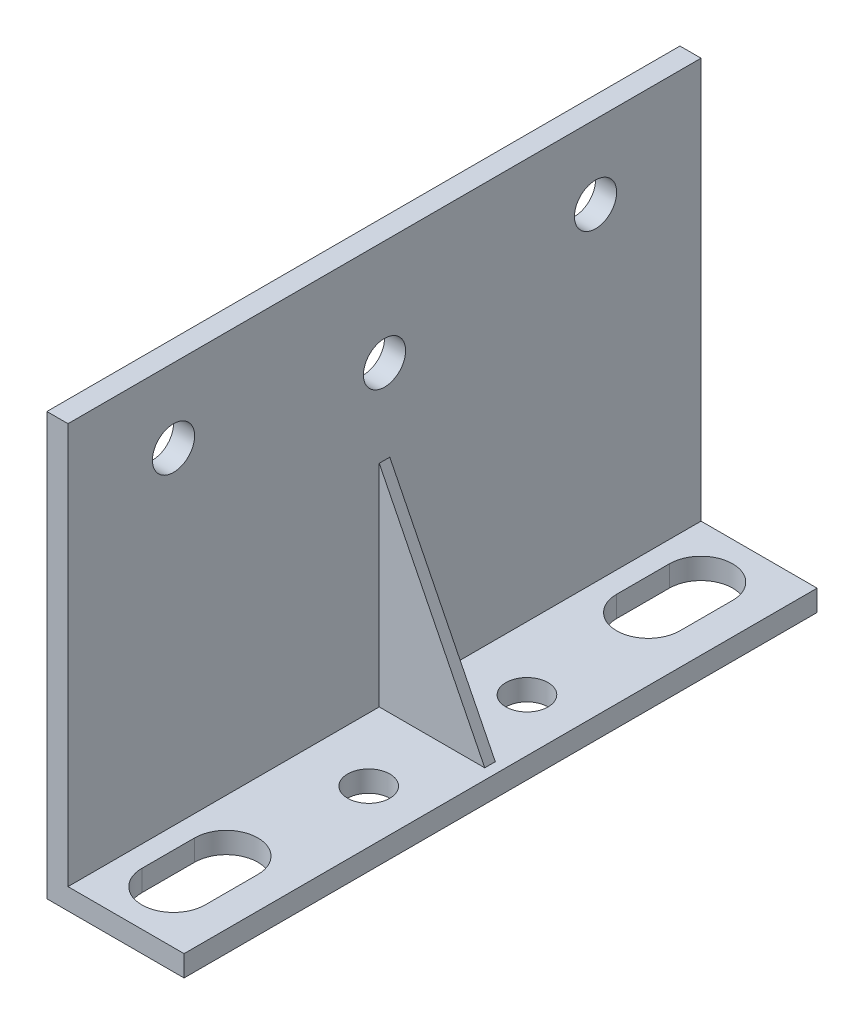
ISO-10303-21;
HEADER;
FILE_DESCRIPTION(('STEP AP214'),'2;1');
FILE_NAME('part.step','',(''),(''),'','','');
FILE_SCHEMA(('AUTOMOTIVE_DESIGN { 1 0 10303 214 1 1 1 1 }'));
ENDSEC;
DATA;
#1=APPLICATION_CONTEXT('core data for automotive mechanical design processes');
#2=APPLICATION_PROTOCOL_DEFINITION('international standard','automotive_design',2000,#1);
#3=PRODUCT_CONTEXT('',#1,'mechanical');
#4=PRODUCT('Part','Part','',(#3));
#5=PRODUCT_RELATED_PRODUCT_CATEGORY('part','',(#4));
#6=PRODUCT_DEFINITION_FORMATION('','',#4);
#7=PRODUCT_DEFINITION_CONTEXT('part definition',#1,'design');
#8=PRODUCT_DEFINITION('design','',#6,#7);
#9=PRODUCT_DEFINITION_SHAPE('','',#8);
#10=(LENGTH_UNIT() NAMED_UNIT(*) SI_UNIT(.MILLI.,.METRE.));
#11=(NAMED_UNIT(*) PLANE_ANGLE_UNIT() SI_UNIT($,.RADIAN.));
#12=(NAMED_UNIT(*) SI_UNIT($,.STERADIAN.) SOLID_ANGLE_UNIT());
#13=UNCERTAINTY_MEASURE_WITH_UNIT(LENGTH_MEASURE(1.E-05),#10,'distance_accuracy_value','');
#14=(GEOMETRIC_REPRESENTATION_CONTEXT(3) GLOBAL_UNCERTAINTY_ASSIGNED_CONTEXT((#13)) GLOBAL_UNIT_ASSIGNED_CONTEXT((#10,
#11,#12)) REPRESENTATION_CONTEXT('',''));
#15=CARTESIAN_POINT('',(0.,0.,0.));
#16=DIRECTION('',(0.,0.,1.));
#17=DIRECTION('',(1.,0.,0.));
#18=AXIS2_PLACEMENT_3D('',#15,#16,#17);
#19=CARTESIAN_POINT('',(0.,0.,60.));
#20=DIRECTION('',(0.,-1.,0.));
#21=DIRECTION('',(1.,0.,0.));
#22=AXIS2_PLACEMENT_3D('',#19,#20,#21);
#23=PLANE('',#22);
#24=CARTESIAN_POINT('',(-5.,0.,22.5));
#25=DIRECTION('',(0.,-1.,0.));
#26=DIRECTION('',(-1.,0.,0.));
#27=AXIS2_PLACEMENT_3D('',#24,#25,#26);
#28=CIRCLE('',#27,2.);
#29=CARTESIAN_POINT('',(-7.,0.,22.5));
#30=VERTEX_POINT('',#29);
#31=EDGE_CURVE('E521',#30,#30,#28,.T.);
#32=ORIENTED_EDGE('',*,*,#31,.T.);
#33=EDGE_LOOP('',(#32));
#34=FACE_BOUND('',#33,.T.);
#35=CARTESIAN_POINT('',(-5.,0.,37.5));
#36=DIRECTION('',(0.,1.,0.));
#37=DIRECTION('',(-1.,0.,0.));
#38=AXIS2_PLACEMENT_3D('',#35,#36,#37);
#39=CIRCLE('',#38,2.);
#40=CARTESIAN_POINT('',(-7.,0.,37.5));
#41=VERTEX_POINT('',#40);
#42=EDGE_CURVE('E526',#41,#41,#39,.T.);
#43=ORIENTED_EDGE('',*,*,#42,.F.);
#44=EDGE_LOOP('',(#43));
#45=FACE_BOUND('',#44,.T.);
#46=DIRECTION('',(0.,0.,-1.));
#47=VECTOR('',#46,1.);
#48=CARTESIAN_POINT('',(-1.,0.,30.5));
#49=LINE('',#48,#47);
#50=CARTESIAN_POINT('',(-0.999999999999999,0.,30.5));
#51=VERTEX_POINT('',#50);
#52=CARTESIAN_POINT('',(-1.,0.,29.5));
#53=VERTEX_POINT('',#52);
#54=EDGE_CURVE('E239',#51,#53,#49,.T.);
#55=ORIENTED_EDGE('',*,*,#54,.F.);
#56=DIRECTION('',(1.,0.,0.));
#57=VECTOR('',#56,1.);
#58=CARTESIAN_POINT('',(-11.,0.,30.5));
#59=LINE('',#58,#57);
#60=CARTESIAN_POINT('',(-11.,0.,30.5));
#61=VERTEX_POINT('',#60);
#62=EDGE_CURVE('E225',#61,#51,#59,.T.);
#63=ORIENTED_EDGE('',*,*,#62,.F.);
#64=DIRECTION('',(0.,0.,-1.));
#65=VECTOR('',#64,1.);
#66=CARTESIAN_POINT('',(-11.,0.,60.));
#67=LINE('',#66,#65);
#68=CARTESIAN_POINT('',(-11.,0.,60.));
#69=VERTEX_POINT('',#68);
#70=EDGE_CURVE('E46',#69,#61,#67,.T.);
#71=ORIENTED_EDGE('',*,*,#70,.F.);
#72=DIRECTION('',(-1.,0.,0.));
#73=VECTOR('',#72,1.);
#74=CARTESIAN_POINT('',(0.,0.,60.));
#75=LINE('',#74,#73);
#76=CARTESIAN_POINT('',(0.,0.,60.));
#77=VERTEX_POINT('',#76);
#78=EDGE_CURVE('E246',#77,#69,#75,.T.);
#79=ORIENTED_EDGE('',*,*,#78,.F.);
#80=DIRECTION('',(0.,0.,-1.));
#81=VECTOR('',#80,1.);
#82=CARTESIAN_POINT('',(0.,0.,60.));
#83=LINE('',#82,#81);
#84=CARTESIAN_POINT('',(0.,0.,0.));
#85=VERTEX_POINT('',#84);
#86=EDGE_CURVE('E11',#77,#85,#83,.T.);
#87=ORIENTED_EDGE('',*,*,#86,.T.);
#88=DIRECTION('',(-1.,0.,0.));
#89=VECTOR('',#88,1.);
#90=CARTESIAN_POINT('',(0.,0.,0.));
#91=LINE('',#90,#89);
#92=CARTESIAN_POINT('',(-11.,0.,0.));
#93=VERTEX_POINT('',#92);
#94=EDGE_CURVE('E260',#85,#93,#91,.T.);
#95=ORIENTED_EDGE('',*,*,#94,.T.);
#96=CARTESIAN_POINT('',(-11.,0.,29.5));
#97=VERTEX_POINT('',#96);
#98=EDGE_CURVE('E280',#97,#93,#67,.T.);
#99=ORIENTED_EDGE('',*,*,#98,.F.);
#100=DIRECTION('',(1.,0.,0.));
#101=VECTOR('',#100,1.);
#102=CARTESIAN_POINT('',(-11.,0.,29.5));
#103=LINE('',#102,#101);
#104=EDGE_CURVE('E234',#97,#53,#103,.T.);
#105=ORIENTED_EDGE('',*,*,#104,.T.);
#106=EDGE_LOOP('',(#55,#63,#71,#79,#87,#95,#99,#105));
#107=FACE_BOUND('',#106,.T.);
#108=DIRECTION('',(0.,0.,1.));
#109=VECTOR('',#108,1.);
#110=CARTESIAN_POINT('',(-8.99999999999999,0.,5.));
#111=LINE('',#110,#109);
#112=CARTESIAN_POINT('',(-8.99999999999999,0.,5.));
#113=VERTEX_POINT('',#112);
#114=CARTESIAN_POINT('',(-8.99999999999999,0.,10.));
#115=VERTEX_POINT('',#114);
#116=EDGE_CURVE('E200',#113,#115,#111,.T.);
#117=ORIENTED_EDGE('',*,*,#116,.F.);
#118=CARTESIAN_POINT('',(-5.99999999999999,0.,5.));
#119=DIRECTION('',(0.,1.,0.));
#120=DIRECTION('',(-1.,0.,0.));
#121=AXIS2_PLACEMENT_3D('',#118,#119,#120);
#122=CIRCLE('',#121,3.);
#123=CARTESIAN_POINT('',(-2.99999999999999,0.,5.));
#124=VERTEX_POINT('',#123);
#125=EDGE_CURVE('E198',#124,#113,#122,.T.);
#126=ORIENTED_EDGE('',*,*,#125,.F.);
#127=DIRECTION('',(0.,0.,-1.));
#128=VECTOR('',#127,1.);
#129=CARTESIAN_POINT('',(-2.99999999999999,0.,5.));
#130=LINE('',#129,#128);
#131=CARTESIAN_POINT('',(-2.99999999999999,0.,10.));
#132=VERTEX_POINT('',#131);
#133=EDGE_CURVE('E206',#132,#124,#130,.T.);
#134=ORIENTED_EDGE('',*,*,#133,.F.);
#135=CARTESIAN_POINT('',(-5.99999999999999,0.,10.));
#136=DIRECTION('',(0.,1.,0.));
#137=DIRECTION('',(-1.,0.,0.));
#138=AXIS2_PLACEMENT_3D('',#135,#136,#137);
#139=CIRCLE('',#138,3.);
#140=EDGE_CURVE('E203',#115,#132,#139,.T.);
#141=ORIENTED_EDGE('',*,*,#140,.F.);
#142=EDGE_LOOP('',(#117,#126,#134,#141));
#143=FACE_BOUND('',#142,.T.);
#144=CARTESIAN_POINT('',(-5.99999999999999,0.,55.));
#145=DIRECTION('',(0.,-1.,0.));
#146=DIRECTION('',(-1.,0.,0.));
#147=AXIS2_PLACEMENT_3D('',#144,#145,#146);
#148=CIRCLE('',#147,3.);
#149=CARTESIAN_POINT('',(-2.99999999999999,0.,55.));
#150=VERTEX_POINT('',#149);
#151=CARTESIAN_POINT('',(-8.99999999999999,0.,55.));
#152=VERTEX_POINT('',#151);
#153=EDGE_CURVE('E53',#150,#152,#148,.T.);
#154=ORIENTED_EDGE('',*,*,#153,.T.);
#155=DIRECTION('',(0.,0.,-1.));
#156=VECTOR('',#155,1.);
#157=CARTESIAN_POINT('',(-8.99999999999999,0.,55.));
#158=LINE('',#157,#156);
#159=CARTESIAN_POINT('',(-8.99999999999999,0.,50.));
#160=VERTEX_POINT('',#159);
#161=EDGE_CURVE('E169',#152,#160,#158,.T.);
#162=ORIENTED_EDGE('',*,*,#161,.T.);
#163=CARTESIAN_POINT('',(-5.99999999999999,0.,50.));
#164=DIRECTION('',(0.,-1.,0.));
#165=DIRECTION('',(-1.,0.,0.));
#166=AXIS2_PLACEMENT_3D('',#163,#164,#165);
#167=CIRCLE('',#166,3.);
#168=CARTESIAN_POINT('',(-2.99999999999999,0.,50.));
#169=VERTEX_POINT('',#168);
#170=EDGE_CURVE('E182',#160,#169,#167,.T.);
#171=ORIENTED_EDGE('',*,*,#170,.T.);
#172=DIRECTION('',(0.,0.,1.));
#173=VECTOR('',#172,1.);
#174=CARTESIAN_POINT('',(-2.99999999999999,0.,55.));
#175=LINE('',#174,#173);
#176=EDGE_CURVE('E175',#169,#150,#175,.T.);
#177=ORIENTED_EDGE('',*,*,#176,.T.);
#178=EDGE_LOOP('',(#154,#162,#171,#177));
#179=FACE_BOUND('',#178,.T.);
#180=ADVANCED_FACE('F38',(#34,#45,#107,#143,#179),#23,.F.);
#181=CARTESIAN_POINT('',(-13.,-2.,60.));
#182=DIRECTION('',(0.,1.,0.));
#183=DIRECTION('',(0.,0.,1.));
#184=AXIS2_PLACEMENT_3D('',#181,#182,#183);
#185=PLANE('',#184);
#186=CARTESIAN_POINT('',(-5.,-2.,22.5));
#187=DIRECTION('',(0.,1.,0.));
#188=DIRECTION('',(0.,0.,1.));
#189=AXIS2_PLACEMENT_3D('',#186,#187,#188);
#190=CIRCLE('',#189,2.);
#191=CARTESIAN_POINT('',(-5.,-2.,24.5));
#192=VERTEX_POINT('',#191);
#193=EDGE_CURVE('E524',#192,#192,#190,.T.);
#194=ORIENTED_EDGE('',*,*,#193,.T.);
#195=EDGE_LOOP('',(#194));
#196=FACE_BOUND('',#195,.T.);
#197=CARTESIAN_POINT('',(-5.,-2.,37.5));
#198=DIRECTION('',(0.,1.,0.));
#199=DIRECTION('',(0.,0.,1.));
#200=AXIS2_PLACEMENT_3D('',#197,#198,#199);
#201=CIRCLE('',#200,2.);
#202=CARTESIAN_POINT('',(-5.,-2.,39.5));
#203=VERTEX_POINT('',#202);
#204=EDGE_CURVE('E531',#203,#203,#201,.F.);
#205=ORIENTED_EDGE('',*,*,#204,.F.);
#206=EDGE_LOOP('',(#205));
#207=FACE_BOUND('',#206,.T.);
#208=DIRECTION('',(1.,0.,0.));
#209=VECTOR('',#208,1.);
#210=CARTESIAN_POINT('',(-13.,-2.,0.));
#211=LINE('',#210,#209);
#212=CARTESIAN_POINT('',(-13.,-2.,0.));
#213=VERTEX_POINT('',#212);
#214=CARTESIAN_POINT('',(0.,-2.,0.));
#215=VERTEX_POINT('',#214);
#216=EDGE_CURVE('E247',#213,#215,#211,.T.);
#217=ORIENTED_EDGE('',*,*,#216,.T.);
#218=DIRECTION('',(0.,0.,-1.));
#219=VECTOR('',#218,1.);
#220=CARTESIAN_POINT('',(0.,-2.,60.));
#221=LINE('',#220,#219);
#222=CARTESIAN_POINT('',(0.,-2.,60.));
#223=VERTEX_POINT('',#222);
#224=EDGE_CURVE('E257',#223,#215,#221,.T.);
#225=ORIENTED_EDGE('',*,*,#224,.F.);
#226=DIRECTION('',(1.,0.,0.));
#227=VECTOR('',#226,1.);
#228=CARTESIAN_POINT('',(-13.,-2.,60.));
#229=LINE('',#228,#227);
#230=CARTESIAN_POINT('',(-13.,-2.,60.));
#231=VERTEX_POINT('',#230);
#232=EDGE_CURVE('E255',#231,#223,#229,.T.);
#233=ORIENTED_EDGE('',*,*,#232,.F.);
#234=DIRECTION('',(0.,0.,-1.));
#235=VECTOR('',#234,1.);
#236=CARTESIAN_POINT('',(-13.,-2.,60.));
#237=LINE('',#236,#235);
#238=EDGE_CURVE('E272',#231,#213,#237,.T.);
#239=ORIENTED_EDGE('',*,*,#238,.T.);
#240=EDGE_LOOP('',(#217,#225,#233,#239));
#241=FACE_BOUND('',#240,.T.);
#242=DIRECTION('',(0.,0.,1.));
#243=VECTOR('',#242,1.);
#244=CARTESIAN_POINT('',(-2.99999999999999,-2.,5.));
#245=LINE('',#244,#243);
#246=CARTESIAN_POINT('',(-2.99999999999999,-2.,5.));
#247=VERTEX_POINT('',#246);
#248=CARTESIAN_POINT('',(-2.99999999999999,-2.,10.));
#249=VERTEX_POINT('',#248);
#250=EDGE_CURVE('E192',#247,#249,#245,.T.);
#251=ORIENTED_EDGE('',*,*,#250,.F.);
#252=CARTESIAN_POINT('',(-5.99999999999999,-2.,5.));
#253=DIRECTION('',(0.,1.,0.));
#254=DIRECTION('',(0.,0.,1.));
#255=AXIS2_PLACEMENT_3D('',#252,#253,#254);
#256=CIRCLE('',#255,3.);
#257=CARTESIAN_POINT('',(-8.99999999999999,-2.,5.));
#258=VERTEX_POINT('',#257);
#259=EDGE_CURVE('E195',#258,#247,#256,.F.);
#260=ORIENTED_EDGE('',*,*,#259,.F.);
#261=DIRECTION('',(0.,0.,-1.));
#262=VECTOR('',#261,1.);
#263=CARTESIAN_POINT('',(-8.99999999999999,-2.,5.));
#264=LINE('',#263,#262);
#265=CARTESIAN_POINT('',(-8.99999999999999,-2.,10.));
#266=VERTEX_POINT('',#265);
#267=EDGE_CURVE('E212',#266,#258,#264,.T.);
#268=ORIENTED_EDGE('',*,*,#267,.F.);
#269=CARTESIAN_POINT('',(-5.99999999999999,-2.,10.));
#270=DIRECTION('',(0.,1.,0.));
#271=DIRECTION('',(0.,0.,1.));
#272=AXIS2_PLACEMENT_3D('',#269,#270,#271);
#273=CIRCLE('',#272,3.);
#274=EDGE_CURVE('E163',#249,#266,#273,.F.);
#275=ORIENTED_EDGE('',*,*,#274,.F.);
#276=EDGE_LOOP('',(#251,#260,#268,#275));
#277=FACE_BOUND('',#276,.T.);
#278=CARTESIAN_POINT('',(-5.99999999999999,-2.,55.));
#279=DIRECTION('',(0.,1.,0.));
#280=DIRECTION('',(0.,0.,1.));
#281=AXIS2_PLACEMENT_3D('',#278,#279,#280);
#282=CIRCLE('',#281,3.);
#283=CARTESIAN_POINT('',(-8.99999999999999,-2.,55.));
#284=VERTEX_POINT('',#283);
#285=CARTESIAN_POINT('',(-2.99999999999999,-2.,55.));
#286=VERTEX_POINT('',#285);
#287=EDGE_CURVE('E167',#284,#286,#282,.T.);
#288=ORIENTED_EDGE('',*,*,#287,.T.);
#289=DIRECTION('',(0.,0.,-1.));
#290=VECTOR('',#289,1.);
#291=CARTESIAN_POINT('',(-2.99999999999999,-2.,55.));
#292=LINE('',#291,#290);
#293=CARTESIAN_POINT('',(-2.99999999999999,-2.,50.));
#294=VERTEX_POINT('',#293);
#295=EDGE_CURVE('E156',#286,#294,#292,.T.);
#296=ORIENTED_EDGE('',*,*,#295,.T.);
#297=CARTESIAN_POINT('',(-5.99999999999999,-2.,50.));
#298=DIRECTION('',(0.,1.,0.));
#299=DIRECTION('',(0.,0.,1.));
#300=AXIS2_PLACEMENT_3D('',#297,#298,#299);
#301=CIRCLE('',#300,3.);
#302=CARTESIAN_POINT('',(-8.99999999999999,-2.,50.));
#303=VERTEX_POINT('',#302);
#304=EDGE_CURVE('E177',#294,#303,#301,.T.);
#305=ORIENTED_EDGE('',*,*,#304,.T.);
#306=DIRECTION('',(0.,0.,1.));
#307=VECTOR('',#306,1.);
#308=CARTESIAN_POINT('',(-8.99999999999999,-2.,55.));
#309=LINE('',#308,#307);
#310=EDGE_CURVE('E173',#303,#284,#309,.T.);
#311=ORIENTED_EDGE('',*,*,#310,.T.);
#312=EDGE_LOOP('',(#288,#296,#305,#311));
#313=FACE_BOUND('',#312,.T.);
#314=ADVANCED_FACE('F172',(#196,#207,#241,#277,#313),#185,.F.);
#315=CARTESIAN_POINT('',(0.,-2.,60.));
#316=DIRECTION('',(-1.,0.,0.));
#317=DIRECTION('',(0.,0.,1.));
#318=AXIS2_PLACEMENT_3D('',#315,#316,#317);
#319=PLANE('',#318);
#320=DIRECTION('',(0.,1.,0.));
#321=VECTOR('',#320,1.);
#322=CARTESIAN_POINT('',(0.,-2.,0.));
#323=LINE('',#322,#321);
#324=EDGE_CURVE('E242',#215,#85,#323,.T.);
#325=ORIENTED_EDGE('',*,*,#324,.T.);
#326=ORIENTED_EDGE('',*,*,#86,.F.);
#327=DIRECTION('',(0.,1.,0.));
#328=VECTOR('',#327,1.);
#329=CARTESIAN_POINT('',(0.,-2.,60.));
#330=LINE('',#329,#328);
#331=EDGE_CURVE('E243',#223,#77,#330,.T.);
#332=ORIENTED_EDGE('',*,*,#331,.F.);
#333=ORIENTED_EDGE('',*,*,#224,.T.);
#334=EDGE_LOOP('',(#325,#326,#332,#333));
#335=FACE_BOUND('',#334,.T.);
#336=ADVANCED_FACE('F40',(#335),#319,.F.);
#337=CARTESIAN_POINT('',(-11.,0.,60.));
#338=DIRECTION('',(-1.,0.,0.));
#339=DIRECTION('',(0.,0.,1.));
#340=AXIS2_PLACEMENT_3D('',#337,#338,#339);
#341=PLANE('',#340);
#342=CARTESIAN_POINT('',(-11.,28.,30.));
#343=DIRECTION('',(1.,0.,0.));
#344=DIRECTION('',(0.,0.,-1.));
#345=AXIS2_PLACEMENT_3D('',#342,#343,#344);
#346=CIRCLE('',#345,2.);
#347=CARTESIAN_POINT('',(-11.,28.,28.));
#348=VERTEX_POINT('',#347);
#349=EDGE_CURVE('E534',#348,#348,#346,.T.);
#350=ORIENTED_EDGE('',*,*,#349,.F.);
#351=EDGE_LOOP('',(#350));
#352=FACE_BOUND('',#351,.T.);
#353=CARTESIAN_POINT('',(-11.,31.,10.));
#354=DIRECTION('',(-1.,0.,0.));
#355=DIRECTION('',(0.,0.,1.));
#356=AXIS2_PLACEMENT_3D('',#353,#354,#355);
#357=CIRCLE('',#356,2.);
#358=CARTESIAN_POINT('',(-11.,31.,12.));
#359=VERTEX_POINT('',#358);
#360=EDGE_CURVE('E544',#359,#359,#357,.T.);
#361=ORIENTED_EDGE('',*,*,#360,.T.);
#362=EDGE_LOOP('',(#361));
#363=FACE_BOUND('',#362,.T.);
#364=CARTESIAN_POINT('',(-11.,31.,50.));
#365=DIRECTION('',(-1.,0.,0.));
#366=DIRECTION('',(0.,0.,1.));
#367=AXIS2_PLACEMENT_3D('',#364,#365,#366);
#368=CIRCLE('',#367,2.);
#369=CARTESIAN_POINT('',(-11.,31.,52.));
#370=VERTEX_POINT('',#369);
#371=EDGE_CURVE('E540',#370,#370,#368,.T.);
#372=ORIENTED_EDGE('',*,*,#371,.T.);
#373=EDGE_LOOP('',(#372));
#374=FACE_BOUND('',#373,.T.);
#375=ORIENTED_EDGE('',*,*,#70,.T.);
#376=DIRECTION('',(0.,-1.,0.));
#377=VECTOR('',#376,1.);
#378=CARTESIAN_POINT('',(-11.,20.,30.5));
#379=LINE('',#378,#377);
#380=CARTESIAN_POINT('',(-11.,20.,30.5));
#381=VERTEX_POINT('',#380);
#382=EDGE_CURVE('E222',#381,#61,#379,.T.);
#383=ORIENTED_EDGE('',*,*,#382,.F.);
#384=DIRECTION('',(0.,0.,-1.));
#385=VECTOR('',#384,1.);
#386=CARTESIAN_POINT('',(-11.,20.,30.5));
#387=LINE('',#386,#385);
#388=CARTESIAN_POINT('',(-11.,20.,29.5));
#389=VERTEX_POINT('',#388);
#390=EDGE_CURVE('E232',#381,#389,#387,.T.);
#391=ORIENTED_EDGE('',*,*,#390,.T.);
#392=DIRECTION('',(0.,-1.,0.));
#393=VECTOR('',#392,1.);
#394=CARTESIAN_POINT('',(-11.,20.,29.5));
#395=LINE('',#394,#393);
#396=EDGE_CURVE('E221',#389,#97,#395,.T.);
#397=ORIENTED_EDGE('',*,*,#396,.T.);
#398=ORIENTED_EDGE('',*,*,#98,.T.);
#399=DIRECTION('',(0.,1.,0.));
#400=VECTOR('',#399,1.);
#401=CARTESIAN_POINT('',(-11.,0.,0.));
#402=LINE('',#401,#400);
#403=CARTESIAN_POINT('',(-11.,38.,0.));
#404=VERTEX_POINT('',#403);
#405=EDGE_CURVE('E263',#93,#404,#402,.T.);
#406=ORIENTED_EDGE('',*,*,#405,.T.);
#407=DIRECTION('',(0.,0.,-1.));
#408=VECTOR('',#407,1.);
#409=CARTESIAN_POINT('',(-11.,38.,60.));
#410=LINE('',#409,#408);
#411=CARTESIAN_POINT('',(-11.,38.,60.));
#412=VERTEX_POINT('',#411);
#413=EDGE_CURVE('E278',#412,#404,#410,.T.);
#414=ORIENTED_EDGE('',*,*,#413,.F.);
#415=DIRECTION('',(0.,1.,0.));
#416=VECTOR('',#415,1.);
#417=CARTESIAN_POINT('',(-11.,0.,60.));
#418=LINE('',#417,#416);
#419=EDGE_CURVE('E249',#69,#412,#418,.T.);
#420=ORIENTED_EDGE('',*,*,#419,.F.);
#421=EDGE_LOOP('',(#375,#383,#391,#397,#398,#406,#414,#420));
#422=FACE_BOUND('',#421,.T.);
#423=ADVANCED_FACE('F286',(#352,#363,#374,#422),#341,.F.);
#424=CARTESIAN_POINT('',(-11.,38.,60.));
#425=DIRECTION('',(0.,-1.,0.));
#426=DIRECTION('',(0.,0.,-1.));
#427=AXIS2_PLACEMENT_3D('',#424,#425,#426);
#428=PLANE('',#427);
#429=DIRECTION('',(-1.,0.,0.));
#430=VECTOR('',#429,1.);
#431=CARTESIAN_POINT('',(-11.,38.,0.));
#432=LINE('',#431,#430);
#433=CARTESIAN_POINT('',(-13.,38.,0.));
#434=VERTEX_POINT('',#433);
#435=EDGE_CURVE('E265',#404,#434,#432,.T.);
#436=ORIENTED_EDGE('',*,*,#435,.T.);
#437=DIRECTION('',(0.,0.,-1.));
#438=VECTOR('',#437,1.);
#439=CARTESIAN_POINT('',(-13.,38.,60.));
#440=LINE('',#439,#438);
#441=CARTESIAN_POINT('',(-13.,38.,60.));
#442=VERTEX_POINT('',#441);
#443=EDGE_CURVE('E275',#442,#434,#440,.T.);
#444=ORIENTED_EDGE('',*,*,#443,.F.);
#445=DIRECTION('',(-1.,0.,0.));
#446=VECTOR('',#445,1.);
#447=CARTESIAN_POINT('',(-11.,38.,60.));
#448=LINE('',#447,#446);
#449=EDGE_CURVE('E251',#412,#442,#448,.T.);
#450=ORIENTED_EDGE('',*,*,#449,.F.);
#451=ORIENTED_EDGE('',*,*,#413,.T.);
#452=EDGE_LOOP('',(#436,#444,#450,#451));
#453=FACE_BOUND('',#452,.T.);
#454=ADVANCED_FACE('F302',(#453),#428,.F.);
#455=CARTESIAN_POINT('',(-13.,38.,60.));
#456=DIRECTION('',(1.,0.,0.));
#457=DIRECTION('',(0.,1.,0.));
#458=AXIS2_PLACEMENT_3D('',#455,#456,#457);
#459=PLANE('',#458);
#460=CARTESIAN_POINT('',(-13.,28.,30.));
#461=DIRECTION('',(1.,0.,0.));
#462=DIRECTION('',(0.,1.,0.));
#463=AXIS2_PLACEMENT_3D('',#460,#461,#462);
#464=CIRCLE('',#463,2.);
#465=CARTESIAN_POINT('',(-13.,30.,30.));
#466=VERTEX_POINT('',#465);
#467=EDGE_CURVE('E537',#466,#466,#464,.F.);
#468=ORIENTED_EDGE('',*,*,#467,.F.);
#469=EDGE_LOOP('',(#468));
#470=FACE_BOUND('',#469,.T.);
#471=CARTESIAN_POINT('',(-13.,31.,10.));
#472=DIRECTION('',(1.,0.,0.));
#473=DIRECTION('',(0.,1.,0.));
#474=AXIS2_PLACEMENT_3D('',#471,#472,#473);
#475=CIRCLE('',#474,2.);
#476=CARTESIAN_POINT('',(-13.,33.,10.));
#477=VERTEX_POINT('',#476);
#478=EDGE_CURVE('E541',#477,#477,#475,.T.);
#479=ORIENTED_EDGE('',*,*,#478,.T.);
#480=EDGE_LOOP('',(#479));
#481=FACE_BOUND('',#480,.T.);
#482=CARTESIAN_POINT('',(-13.,31.,50.));
#483=DIRECTION('',(1.,0.,0.));
#484=DIRECTION('',(0.,1.,0.));
#485=AXIS2_PLACEMENT_3D('',#482,#483,#484);
#486=CIRCLE('',#485,2.);
#487=CARTESIAN_POINT('',(-13.,33.,50.));
#488=VERTEX_POINT('',#487);
#489=EDGE_CURVE('E547',#488,#488,#486,.T.);
#490=ORIENTED_EDGE('',*,*,#489,.T.);
#491=EDGE_LOOP('',(#490));
#492=FACE_BOUND('',#491,.T.);
#493=DIRECTION('',(0.,-1.,0.));
#494=VECTOR('',#493,1.);
#495=CARTESIAN_POINT('',(-13.,38.,0.));
#496=LINE('',#495,#494);
#497=EDGE_CURVE('E267',#434,#213,#496,.T.);
#498=ORIENTED_EDGE('',*,*,#497,.T.);
#499=ORIENTED_EDGE('',*,*,#238,.F.);
#500=DIRECTION('',(0.,-1.,0.));
#501=VECTOR('',#500,1.);
#502=CARTESIAN_POINT('',(-13.,38.,60.));
#503=LINE('',#502,#501);
#504=EDGE_CURVE('E253',#442,#231,#503,.T.);
#505=ORIENTED_EDGE('',*,*,#504,.F.);
#506=ORIENTED_EDGE('',*,*,#443,.T.);
#507=EDGE_LOOP('',(#498,#499,#505,#506));
#508=FACE_BOUND('',#507,.T.);
#509=ADVANCED_FACE('F306',(#470,#481,#492,#508),#459,.F.);
#510=CARTESIAN_POINT('',(0.,0.,60.));
#511=DIRECTION('',(0.,0.,1.));
#512=DIRECTION('',(1.,0.,0.));
#513=AXIS2_PLACEMENT_3D('',#510,#511,#512);
#514=PLANE('',#513);
#515=ORIENTED_EDGE('',*,*,#331,.T.);
#516=ORIENTED_EDGE('',*,*,#78,.T.);
#517=ORIENTED_EDGE('',*,*,#419,.T.);
#518=ORIENTED_EDGE('',*,*,#449,.T.);
#519=ORIENTED_EDGE('',*,*,#504,.T.);
#520=ORIENTED_EDGE('',*,*,#232,.T.);
#521=EDGE_LOOP('',(#515,#516,#517,#518,#519,#520));
#522=FACE_BOUND('',#521,.T.);
#523=ADVANCED_FACE('F310',(#522),#514,.T.);
#524=CARTESIAN_POINT('',(0.,0.,0.));
#525=DIRECTION('',(0.,0.,1.));
#526=DIRECTION('',(1.,0.,0.));
#527=AXIS2_PLACEMENT_3D('',#524,#525,#526);
#528=PLANE('',#527);
#529=ORIENTED_EDGE('',*,*,#324,.F.);
#530=ORIENTED_EDGE('',*,*,#216,.F.);
#531=ORIENTED_EDGE('',*,*,#497,.F.);
#532=ORIENTED_EDGE('',*,*,#435,.F.);
#533=ORIENTED_EDGE('',*,*,#405,.F.);
#534=ORIENTED_EDGE('',*,*,#94,.F.);
#535=EDGE_LOOP('',(#529,#530,#531,#532,#533,#534));
#536=FACE_BOUND('',#535,.T.);
#537=ADVANCED_FACE('F297',(#536),#528,.F.);
#538=CARTESIAN_POINT('',(-11.,20.,30.5));
#539=DIRECTION('',(-0.894427190999916,-0.447213595499958,0.));
#540=DIRECTION('',(0.447213595499958,-0.894427190999916,0.));
#541=AXIS2_PLACEMENT_3D('',#538,#539,#540);
#542=PLANE('',#541);
#543=DIRECTION('',(-0.447213595499958,0.894427190999916,0.));
#544=VECTOR('',#543,1.);
#545=CARTESIAN_POINT('',(-11.,20.,29.5));
#546=LINE('',#545,#544);
#547=EDGE_CURVE('E226',#53,#389,#546,.T.);
#548=ORIENTED_EDGE('',*,*,#547,.T.);
#549=ORIENTED_EDGE('',*,*,#390,.F.);
#550=DIRECTION('',(-0.447213595499958,0.894427190999916,0.));
#551=VECTOR('',#550,1.);
#552=CARTESIAN_POINT('',(-11.,20.,30.5));
#553=LINE('',#552,#551);
#554=EDGE_CURVE('E229',#51,#381,#553,.T.);
#555=ORIENTED_EDGE('',*,*,#554,.F.);
#556=ORIENTED_EDGE('',*,*,#54,.T.);
#557=EDGE_LOOP('',(#548,#549,#555,#556));
#558=FACE_BOUND('',#557,.T.);
#559=ADVANCED_FACE('F318',(#558),#542,.F.);
#560=CARTESIAN_POINT('',(0.,0.,30.5));
#561=DIRECTION('',(0.,0.,1.));
#562=DIRECTION('',(1.,0.,0.));
#563=AXIS2_PLACEMENT_3D('',#560,#561,#562);
#564=PLANE('',#563);
#565=ORIENTED_EDGE('',*,*,#382,.T.);
#566=ORIENTED_EDGE('',*,*,#62,.T.);
#567=ORIENTED_EDGE('',*,*,#554,.T.);
#568=EDGE_LOOP('',(#565,#566,#567));
#569=FACE_BOUND('',#568,.T.);
#570=ADVANCED_FACE('F315',(#569),#564,.T.);
#571=CARTESIAN_POINT('',(0.,0.,29.5));
#572=DIRECTION('',(0.,0.,1.));
#573=DIRECTION('',(1.,0.,0.));
#574=AXIS2_PLACEMENT_3D('',#571,#572,#573);
#575=PLANE('',#574);
#576=ORIENTED_EDGE('',*,*,#396,.F.);
#577=ORIENTED_EDGE('',*,*,#547,.F.);
#578=ORIENTED_EDGE('',*,*,#104,.F.);
#579=EDGE_LOOP('',(#576,#577,#578));
#580=FACE_BOUND('',#579,.T.);
#581=ADVANCED_FACE('F321',(#580),#575,.F.);
#582=CARTESIAN_POINT('',(-5.99999999999999,-2.001,5.));
#583=DIRECTION('',(0.,1.,0.));
#584=DIRECTION('',(-1.,0.,0.));
#585=AXIS2_PLACEMENT_3D('',#582,#583,#584);
#586=CYLINDRICAL_SURFACE('',#585,3.);
#587=ORIENTED_EDGE('',*,*,#259,.T.);
#588=DIRECTION('',(0.,1.,0.));
#589=VECTOR('',#588,1.);
#590=CARTESIAN_POINT('',(-2.99999999999999,-2.001,5.));
#591=LINE('',#590,#589);
#592=EDGE_CURVE('E210',#247,#124,#591,.T.);
#593=ORIENTED_EDGE('',*,*,#592,.T.);
#594=ORIENTED_EDGE('',*,*,#125,.T.);
#595=DIRECTION('',(0.,1.,0.));
#596=VECTOR('',#595,1.);
#597=CARTESIAN_POINT('',(-8.99999999999999,-2.001,5.));
#598=LINE('',#597,#596);
#599=EDGE_CURVE('E209',#258,#113,#598,.T.);
#600=ORIENTED_EDGE('',*,*,#599,.F.);
#601=EDGE_LOOP('',(#587,#593,#594,#600));
#602=FACE_BOUND('',#601,.T.);
#603=ADVANCED_FACE('F323',(#602),#586,.F.);
#604=CARTESIAN_POINT('',(-2.99999999999999,-2.001,5.));
#605=DIRECTION('',(1.,0.,0.));
#606=DIRECTION('',(0.,1.,0.));
#607=AXIS2_PLACEMENT_3D('',#604,#605,#606);
#608=PLANE('',#607);
#609=ORIENTED_EDGE('',*,*,#250,.T.);
#610=DIRECTION('',(0.,1.,0.));
#611=VECTOR('',#610,1.);
#612=CARTESIAN_POINT('',(-2.99999999999999,-2.001,10.));
#613=LINE('',#612,#611);
#614=EDGE_CURVE('E213',#249,#132,#613,.T.);
#615=ORIENTED_EDGE('',*,*,#614,.T.);
#616=ORIENTED_EDGE('',*,*,#133,.T.);
#617=ORIENTED_EDGE('',*,*,#592,.F.);
#618=EDGE_LOOP('',(#609,#615,#616,#617));
#619=FACE_BOUND('',#618,.T.);
#620=ADVANCED_FACE('F329',(#619),#608,.F.);
#621=CARTESIAN_POINT('',(-5.99999999999999,-2.001,10.));
#622=DIRECTION('',(0.,1.,0.));
#623=DIRECTION('',(-1.,0.,0.));
#624=AXIS2_PLACEMENT_3D('',#621,#622,#623);
#625=CYLINDRICAL_SURFACE('',#624,3.);
#626=ORIENTED_EDGE('',*,*,#274,.T.);
#627=DIRECTION('',(0.,1.,0.));
#628=VECTOR('',#627,1.);
#629=CARTESIAN_POINT('',(-8.99999999999999,-2.001,10.));
#630=LINE('',#629,#628);
#631=EDGE_CURVE('E215',#266,#115,#630,.T.);
#632=ORIENTED_EDGE('',*,*,#631,.T.);
#633=ORIENTED_EDGE('',*,*,#140,.T.);
#634=ORIENTED_EDGE('',*,*,#614,.F.);
#635=EDGE_LOOP('',(#626,#632,#633,#634));
#636=FACE_BOUND('',#635,.T.);
#637=ADVANCED_FACE('F383',(#636),#625,.F.);
#638=CARTESIAN_POINT('',(-8.99999999999999,-2.001,5.));
#639=DIRECTION('',(-1.,0.,0.));
#640=DIRECTION('',(0.,-1.,0.));
#641=AXIS2_PLACEMENT_3D('',#638,#639,#640);
#642=PLANE('',#641);
#643=ORIENTED_EDGE('',*,*,#267,.T.);
#644=ORIENTED_EDGE('',*,*,#599,.T.);
#645=ORIENTED_EDGE('',*,*,#116,.T.);
#646=ORIENTED_EDGE('',*,*,#631,.F.);
#647=EDGE_LOOP('',(#643,#644,#645,#646));
#648=FACE_BOUND('',#647,.T.);
#649=ADVANCED_FACE('F393',(#648),#642,.F.);
#650=CARTESIAN_POINT('',(-5.99999999999999,-2.001,55.));
#651=DIRECTION('',(0.,1.,0.));
#652=DIRECTION('',(-1.,0.,0.));
#653=AXIS2_PLACEMENT_3D('',#650,#651,#652);
#654=CYLINDRICAL_SURFACE('',#653,3.);
#655=DIRECTION('',(0.,1.,0.));
#656=VECTOR('',#655,1.);
#657=CARTESIAN_POINT('',(-8.99999999999999,-2.001,55.));
#658=LINE('',#657,#656);
#659=EDGE_CURVE('E164',#284,#152,#658,.T.);
#660=ORIENTED_EDGE('',*,*,#659,.T.);
#661=ORIENTED_EDGE('',*,*,#153,.F.);
#662=DIRECTION('',(0.,1.,0.));
#663=VECTOR('',#662,1.);
#664=CARTESIAN_POINT('',(-2.99999999999999,-2.001,55.));
#665=LINE('',#664,#663);
#666=EDGE_CURVE('E158',#286,#150,#665,.T.);
#667=ORIENTED_EDGE('',*,*,#666,.F.);
#668=ORIENTED_EDGE('',*,*,#287,.F.);
#669=EDGE_LOOP('',(#660,#661,#667,#668));
#670=FACE_BOUND('',#669,.T.);
#671=ADVANCED_FACE('F166',(#670),#654,.F.);
#672=CARTESIAN_POINT('',(-8.99999999999999,-2.001,55.));
#673=DIRECTION('',(1.,0.,0.));
#674=DIRECTION('',(0.,1.,0.));
#675=AXIS2_PLACEMENT_3D('',#672,#673,#674);
#676=PLANE('',#675);
#677=DIRECTION('',(0.,1.,0.));
#678=VECTOR('',#677,1.);
#679=CARTESIAN_POINT('',(-8.99999999999999,-2.001,50.));
#680=LINE('',#679,#678);
#681=EDGE_CURVE('E188',#303,#160,#680,.T.);
#682=ORIENTED_EDGE('',*,*,#681,.T.);
#683=ORIENTED_EDGE('',*,*,#161,.F.);
#684=ORIENTED_EDGE('',*,*,#659,.F.);
#685=ORIENTED_EDGE('',*,*,#310,.F.);
#686=EDGE_LOOP('',(#682,#683,#684,#685));
#687=FACE_BOUND('',#686,.T.);
#688=ADVANCED_FACE('F413',(#687),#676,.T.);
#689=CARTESIAN_POINT('',(-5.99999999999999,-2.001,50.));
#690=DIRECTION('',(0.,1.,0.));
#691=DIRECTION('',(-1.,0.,0.));
#692=AXIS2_PLACEMENT_3D('',#689,#690,#691);
#693=CYLINDRICAL_SURFACE('',#692,3.);
#694=DIRECTION('',(0.,1.,0.));
#695=VECTOR('',#694,1.);
#696=CARTESIAN_POINT('',(-2.99999999999999,-2.001,50.));
#697=LINE('',#696,#695);
#698=EDGE_CURVE('E61',#294,#169,#697,.T.);
#699=ORIENTED_EDGE('',*,*,#698,.T.);
#700=ORIENTED_EDGE('',*,*,#170,.F.);
#701=ORIENTED_EDGE('',*,*,#681,.F.);
#702=ORIENTED_EDGE('',*,*,#304,.F.);
#703=EDGE_LOOP('',(#699,#700,#701,#702));
#704=FACE_BOUND('',#703,.T.);
#705=ADVANCED_FACE('F423',(#704),#693,.F.);
#706=CARTESIAN_POINT('',(-2.99999999999999,-2.001,55.));
#707=DIRECTION('',(-1.,0.,0.));
#708=DIRECTION('',(0.,-1.,0.));
#709=AXIS2_PLACEMENT_3D('',#706,#707,#708);
#710=PLANE('',#709);
#711=ORIENTED_EDGE('',*,*,#666,.T.);
#712=ORIENTED_EDGE('',*,*,#176,.F.);
#713=ORIENTED_EDGE('',*,*,#698,.F.);
#714=ORIENTED_EDGE('',*,*,#295,.F.);
#715=EDGE_LOOP('',(#711,#712,#713,#714));
#716=FACE_BOUND('',#715,.T.);
#717=ADVANCED_FACE('F157',(#716),#710,.T.);
#718=CARTESIAN_POINT('',(0.00100000000000967,31.,50.));
#719=DIRECTION('',(-1.,0.,0.));
#720=DIRECTION('',(0.,-1.,0.));
#721=AXIS2_PLACEMENT_3D('',#718,#719,#720);
#722=CYLINDRICAL_SURFACE('',#721,2.);
#723=ORIENTED_EDGE('',*,*,#489,.F.);
#724=EDGE_LOOP('',(#723));
#725=FACE_BOUND('',#724,.T.);
#726=ORIENTED_EDGE('',*,*,#371,.F.);
#727=EDGE_LOOP('',(#726));
#728=FACE_BOUND('',#727,.T.);
#729=ADVANCED_FACE('F442',(#725,#728),#722,.F.);
#730=CARTESIAN_POINT('',(0.00100000000000273,31.,10.));
#731=DIRECTION('',(-1.,0.,0.));
#732=DIRECTION('',(0.,-1.,0.));
#733=AXIS2_PLACEMENT_3D('',#730,#731,#732);
#734=CYLINDRICAL_SURFACE('',#733,2.);
#735=ORIENTED_EDGE('',*,*,#478,.F.);
#736=EDGE_LOOP('',(#735));
#737=FACE_BOUND('',#736,.T.);
#738=ORIENTED_EDGE('',*,*,#360,.F.);
#739=EDGE_LOOP('',(#738));
#740=FACE_BOUND('',#739,.T.);
#741=ADVANCED_FACE('F451',(#737,#740),#734,.F.);
#742=CARTESIAN_POINT('',(-13.001,28.,30.));
#743=DIRECTION('',(1.,0.,0.));
#744=DIRECTION('',(0.,0.,-1.));
#745=AXIS2_PLACEMENT_3D('',#742,#743,#744);
#746=CYLINDRICAL_SURFACE('',#745,2.);
#747=ORIENTED_EDGE('',*,*,#349,.T.);
#748=EDGE_LOOP('',(#747));
#749=FACE_BOUND('',#748,.T.);
#750=ORIENTED_EDGE('',*,*,#467,.T.);
#751=EDGE_LOOP('',(#750));
#752=FACE_BOUND('',#751,.T.);
#753=ADVANCED_FACE('F461',(#749,#752),#746,.F.);
#754=CARTESIAN_POINT('',(-5.,-2.001,37.5));
#755=DIRECTION('',(0.,1.,0.));
#756=DIRECTION('',(-1.,0.,0.));
#757=AXIS2_PLACEMENT_3D('',#754,#755,#756);
#758=CYLINDRICAL_SURFACE('',#757,2.);
#759=ORIENTED_EDGE('',*,*,#42,.T.);
#760=EDGE_LOOP('',(#759));
#761=FACE_BOUND('',#760,.T.);
#762=ORIENTED_EDGE('',*,*,#204,.T.);
#763=EDGE_LOOP('',(#762));
#764=FACE_BOUND('',#763,.T.);
#765=ADVANCED_FACE('F487',(#761,#764),#758,.F.);
#766=CARTESIAN_POINT('',(-5.,-2.001,22.5));
#767=DIRECTION('',(0.,1.,0.));
#768=DIRECTION('',(-1.,0.,0.));
#769=AXIS2_PLACEMENT_3D('',#766,#767,#768);
#770=CYLINDRICAL_SURFACE('',#769,2.);
#771=ORIENTED_EDGE('',*,*,#31,.F.);
#772=EDGE_LOOP('',(#771));
#773=FACE_BOUND('',#772,.T.);
#774=ORIENTED_EDGE('',*,*,#193,.F.);
#775=EDGE_LOOP('',(#774));
#776=FACE_BOUND('',#775,.T.);
#777=ADVANCED_FACE('F496',(#773,#776),#770,.F.);
#778=CLOSED_SHELL('',(#180,#314,#336,#423,#454,#509,#523,#537,#559,#570,#581,#603,#620,#637,
#649,#671,#688,#705,#717,#729,#741,#753,#765,#777));
#779=MANIFOLD_SOLID_BREP('B2',#778);
#780=ADVANCED_BREP_SHAPE_REPRESENTATION('',(#18,#779),#14);
#781=SHAPE_DEFINITION_REPRESENTATION(#9,#780);
ENDSEC;
END-ISO-10303-21;
